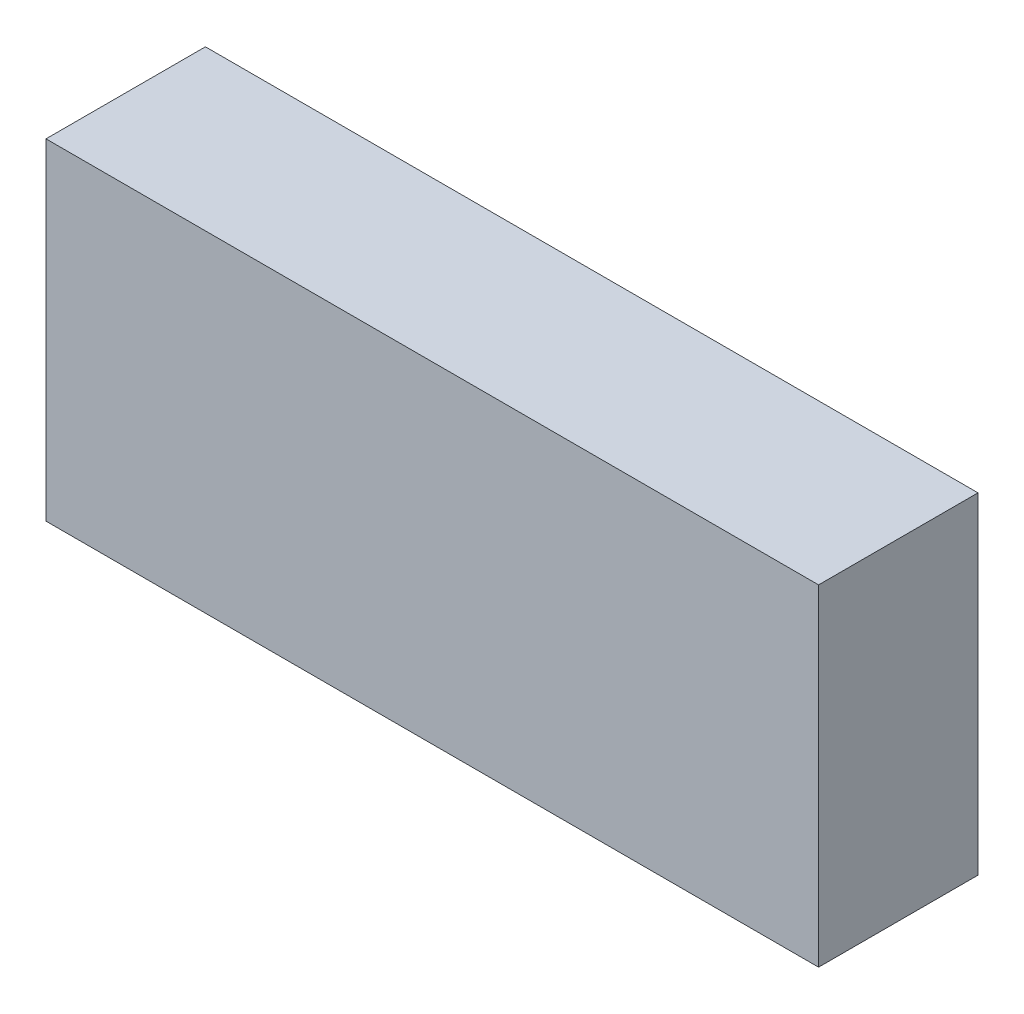
ISO-10303-21;
HEADER;
FILE_DESCRIPTION(('STEP AP214'),'2;1');
FILE_NAME('part.step','',(''),(''),'','','');
FILE_SCHEMA(('AUTOMOTIVE_DESIGN { 1 0 10303 214 1 1 1 1 }'));
ENDSEC;
DATA;
#1=APPLICATION_CONTEXT('core data for automotive mechanical design processes');
#2=APPLICATION_PROTOCOL_DEFINITION('international standard','automotive_design',2000,#1);
#3=PRODUCT_CONTEXT('',#1,'mechanical');
#4=PRODUCT('Part','Part','',(#3));
#5=PRODUCT_RELATED_PRODUCT_CATEGORY('part','',(#4));
#6=PRODUCT_DEFINITION_FORMATION('','',#4);
#7=PRODUCT_DEFINITION_CONTEXT('part definition',#1,'design');
#8=PRODUCT_DEFINITION('design','',#6,#7);
#9=PRODUCT_DEFINITION_SHAPE('','',#8);
#10=(LENGTH_UNIT() NAMED_UNIT(*) SI_UNIT(.MILLI.,.METRE.));
#11=(NAMED_UNIT(*) PLANE_ANGLE_UNIT() SI_UNIT($,.RADIAN.));
#12=(NAMED_UNIT(*) SI_UNIT($,.STERADIAN.) SOLID_ANGLE_UNIT());
#13=UNCERTAINTY_MEASURE_WITH_UNIT(LENGTH_MEASURE(1.E-05),#10,'distance_accuracy_value','');
#14=(GEOMETRIC_REPRESENTATION_CONTEXT(3) GLOBAL_UNCERTAINTY_ASSIGNED_CONTEXT((#13)) GLOBAL_UNIT_ASSIGNED_CONTEXT((#10,
#11,#12)) REPRESENTATION_CONTEXT('',''));
#15=CARTESIAN_POINT('',(0.,0.,0.));
#16=DIRECTION('',(0.,0.,1.));
#17=DIRECTION('',(1.,0.,0.));
#18=AXIS2_PLACEMENT_3D('',#15,#16,#17);
#19=CARTESIAN_POINT('',(31.5,13.5,13.));
#20=DIRECTION('',(-1.,0.,0.));
#21=DIRECTION('',(0.,0.,1.));
#22=AXIS2_PLACEMENT_3D('',#19,#20,#21);
#23=PLANE('',#22);
#24=DIRECTION('',(0.,1.,0.));
#25=VECTOR('',#24,1.);
#26=CARTESIAN_POINT('',(31.5,13.5,0.));
#27=LINE('',#26,#25);
#28=CARTESIAN_POINT('',(31.5,-13.5,0.));
#29=VERTEX_POINT('',#28);
#30=CARTESIAN_POINT('',(31.5,13.5,0.));
#31=VERTEX_POINT('',#30);
#32=EDGE_CURVE('E107',#29,#31,#27,.T.);
#33=ORIENTED_EDGE('',*,*,#32,.T.);
#34=DIRECTION('',(0.,0.,-1.));
#35=VECTOR('',#34,1.);
#36=CARTESIAN_POINT('',(31.5,13.5,13.));
#37=LINE('',#36,#35);
#38=CARTESIAN_POINT('',(31.5,13.5,13.));
#39=VERTEX_POINT('',#38);
#40=EDGE_CURVE('E11',#39,#31,#37,.T.);
#41=ORIENTED_EDGE('',*,*,#40,.F.);
#42=DIRECTION('',(0.,1.,0.));
#43=VECTOR('',#42,1.);
#44=CARTESIAN_POINT('',(31.5,13.5,13.));
#45=LINE('',#44,#43);
#46=CARTESIAN_POINT('',(31.5,-13.5,13.));
#47=VERTEX_POINT('',#46);
#48=EDGE_CURVE('E91',#47,#39,#45,.T.);
#49=ORIENTED_EDGE('',*,*,#48,.F.);
#50=DIRECTION('',(0.,0.,-1.));
#51=VECTOR('',#50,1.);
#52=CARTESIAN_POINT('',(31.5,-13.5,13.));
#53=LINE('',#52,#51);
#54=EDGE_CURVE('E103',#47,#29,#53,.T.);
#55=ORIENTED_EDGE('',*,*,#54,.T.);
#56=EDGE_LOOP('',(#33,#41,#49,#55));
#57=FACE_BOUND('',#56,.T.);
#58=ADVANCED_FACE('F39',(#57),#23,.F.);
#59=CARTESIAN_POINT('',(-31.5,13.5,13.));
#60=DIRECTION('',(0.,-1.,0.));
#61=DIRECTION('',(0.,0.,-1.));
#62=AXIS2_PLACEMENT_3D('',#59,#60,#61);
#63=PLANE('',#62);
#64=DIRECTION('',(-1.,0.,0.));
#65=VECTOR('',#64,1.);
#66=CARTESIAN_POINT('',(-31.5,13.5,0.));
#67=LINE('',#66,#65);
#68=CARTESIAN_POINT('',(-31.5,13.5,0.));
#69=VERTEX_POINT('',#68);
#70=EDGE_CURVE('E96',#31,#69,#67,.T.);
#71=ORIENTED_EDGE('',*,*,#70,.T.);
#72=DIRECTION('',(0.,0.,-1.));
#73=VECTOR('',#72,1.);
#74=CARTESIAN_POINT('',(-31.5,13.5,13.));
#75=LINE('',#74,#73);
#76=CARTESIAN_POINT('',(-31.5,13.5,13.));
#77=VERTEX_POINT('',#76);
#78=EDGE_CURVE('E48',#77,#69,#75,.T.);
#79=ORIENTED_EDGE('',*,*,#78,.F.);
#80=DIRECTION('',(-1.,0.,0.));
#81=VECTOR('',#80,1.);
#82=CARTESIAN_POINT('',(-31.5,13.5,13.));
#83=LINE('',#82,#81);
#84=EDGE_CURVE('E86',#39,#77,#83,.T.);
#85=ORIENTED_EDGE('',*,*,#84,.F.);
#86=ORIENTED_EDGE('',*,*,#40,.T.);
#87=EDGE_LOOP('',(#71,#79,#85,#86));
#88=FACE_BOUND('',#87,.T.);
#89=ADVANCED_FACE('F95',(#88),#63,.F.);
#90=CARTESIAN_POINT('',(-31.5,13.5,13.));
#91=DIRECTION('',(1.,0.,0.));
#92=DIRECTION('',(0.,0.,-1.));
#93=AXIS2_PLACEMENT_3D('',#90,#91,#92);
#94=PLANE('',#93);
#95=DIRECTION('',(0.,-1.,0.));
#96=VECTOR('',#95,1.);
#97=CARTESIAN_POINT('',(-31.5,13.5,0.));
#98=LINE('',#97,#96);
#99=CARTESIAN_POINT('',(-31.5,-13.5,0.));
#100=VERTEX_POINT('',#99);
#101=EDGE_CURVE('E73',#69,#100,#98,.T.);
#102=ORIENTED_EDGE('',*,*,#101,.T.);
#103=DIRECTION('',(0.,0.,-1.));
#104=VECTOR('',#103,1.);
#105=CARTESIAN_POINT('',(-31.5,-13.5,13.));
#106=LINE('',#105,#104);
#107=CARTESIAN_POINT('',(-31.5,-13.5,13.));
#108=VERTEX_POINT('',#107);
#109=EDGE_CURVE('E98',#108,#100,#106,.T.);
#110=ORIENTED_EDGE('',*,*,#109,.F.);
#111=DIRECTION('',(0.,-1.,0.));
#112=VECTOR('',#111,1.);
#113=CARTESIAN_POINT('',(-31.5,13.5,13.));
#114=LINE('',#113,#112);
#115=EDGE_CURVE('E89',#77,#108,#114,.T.);
#116=ORIENTED_EDGE('',*,*,#115,.F.);
#117=ORIENTED_EDGE('',*,*,#78,.T.);
#118=EDGE_LOOP('',(#102,#110,#116,#117));
#119=FACE_BOUND('',#118,.T.);
#120=ADVANCED_FACE('F99',(#119),#94,.F.);
#121=CARTESIAN_POINT('',(-31.5,-13.5,13.));
#122=DIRECTION('',(0.,1.,0.));
#123=DIRECTION('',(0.,0.,1.));
#124=AXIS2_PLACEMENT_3D('',#121,#122,#123);
#125=PLANE('',#124);
#126=DIRECTION('',(1.,0.,0.));
#127=VECTOR('',#126,1.);
#128=CARTESIAN_POINT('',(-31.5,-13.5,0.));
#129=LINE('',#128,#127);
#130=EDGE_CURVE('E79',#100,#29,#129,.T.);
#131=ORIENTED_EDGE('',*,*,#130,.T.);
#132=ORIENTED_EDGE('',*,*,#54,.F.);
#133=DIRECTION('',(1.,0.,0.));
#134=VECTOR('',#133,1.);
#135=CARTESIAN_POINT('',(-31.5,-13.5,13.));
#136=LINE('',#135,#134);
#137=EDGE_CURVE('E56',#108,#47,#136,.T.);
#138=ORIENTED_EDGE('',*,*,#137,.F.);
#139=ORIENTED_EDGE('',*,*,#109,.T.);
#140=EDGE_LOOP('',(#131,#132,#138,#139));
#141=FACE_BOUND('',#140,.T.);
#142=ADVANCED_FACE('F120',(#141),#125,.F.);
#143=CARTESIAN_POINT('',(0.,0.,13.));
#144=DIRECTION('',(0.,0.,1.));
#145=DIRECTION('',(1.,0.,0.));
#146=AXIS2_PLACEMENT_3D('',#143,#144,#145);
#147=PLANE('',#146);
#148=ORIENTED_EDGE('',*,*,#48,.T.);
#149=ORIENTED_EDGE('',*,*,#84,.T.);
#150=ORIENTED_EDGE('',*,*,#115,.T.);
#151=ORIENTED_EDGE('',*,*,#137,.T.);
#152=EDGE_LOOP('',(#148,#149,#150,#151));
#153=FACE_BOUND('',#152,.T.);
#154=ADVANCED_FACE('F87',(#153),#147,.T.);
#155=CARTESIAN_POINT('',(0.,0.,0.));
#156=DIRECTION('',(0.,0.,1.));
#157=DIRECTION('',(1.,0.,0.));
#158=AXIS2_PLACEMENT_3D('',#155,#156,#157);
#159=PLANE('',#158);
#160=ORIENTED_EDGE('',*,*,#32,.F.);
#161=ORIENTED_EDGE('',*,*,#130,.F.);
#162=ORIENTED_EDGE('',*,*,#101,.F.);
#163=ORIENTED_EDGE('',*,*,#70,.F.);
#164=EDGE_LOOP('',(#160,#161,#162,#163));
#165=FACE_BOUND('',#164,.T.);
#166=ADVANCED_FACE('F123',(#165),#159,.F.);
#167=CLOSED_SHELL('',(#58,#89,#120,#142,#154,#166));
#168=MANIFOLD_SOLID_BREP('B2',#167);
#169=ADVANCED_BREP_SHAPE_REPRESENTATION('',(#18,#168),#14);
#170=SHAPE_DEFINITION_REPRESENTATION(#9,#169);
ENDSEC;
END-ISO-10303-21;
